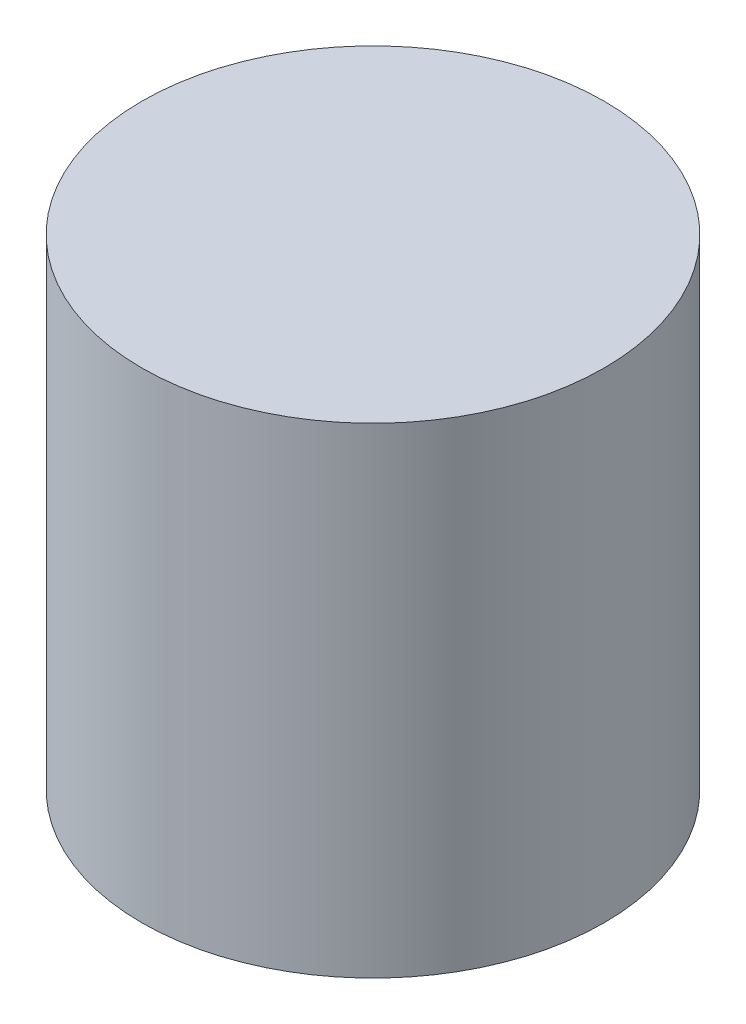
ISO-10303-21;
HEADER;
FILE_DESCRIPTION(('STEP AP214'),'2;1');
FILE_NAME('part.step','',(''),(''),'','','');
FILE_SCHEMA(('AUTOMOTIVE_DESIGN { 1 0 10303 214 1 1 1 1 }'));
ENDSEC;
DATA;
#1=APPLICATION_CONTEXT('core data for automotive mechanical design processes');
#2=APPLICATION_PROTOCOL_DEFINITION('international standard','automotive_design',2000,#1);
#3=PRODUCT_CONTEXT('',#1,'mechanical');
#4=PRODUCT('Part','Part','',(#3));
#5=PRODUCT_RELATED_PRODUCT_CATEGORY('part','',(#4));
#6=PRODUCT_DEFINITION_FORMATION('','',#4);
#7=PRODUCT_DEFINITION_CONTEXT('part definition',#1,'design');
#8=PRODUCT_DEFINITION('design','',#6,#7);
#9=PRODUCT_DEFINITION_SHAPE('','',#8);
#10=(LENGTH_UNIT() NAMED_UNIT(*) SI_UNIT(.MILLI.,.METRE.));
#11=(NAMED_UNIT(*) PLANE_ANGLE_UNIT() SI_UNIT($,.RADIAN.));
#12=(NAMED_UNIT(*) SI_UNIT($,.STERADIAN.) SOLID_ANGLE_UNIT());
#13=UNCERTAINTY_MEASURE_WITH_UNIT(LENGTH_MEASURE(1.E-05),#10,'distance_accuracy_value','');
#14=(GEOMETRIC_REPRESENTATION_CONTEXT(3) GLOBAL_UNCERTAINTY_ASSIGNED_CONTEXT((#13)) GLOBAL_UNIT_ASSIGNED_CONTEXT((#10,
#11,#12)) REPRESENTATION_CONTEXT('',''));
#15=CARTESIAN_POINT('',(0.,0.,0.));
#16=DIRECTION('',(0.,0.,1.));
#17=DIRECTION('',(1.,0.,0.));
#18=AXIS2_PLACEMENT_3D('',#15,#16,#17);
#19=CARTESIAN_POINT('',(0.,79.,0.));
#20=DIRECTION('',(0.,-1.,0.));
#21=DIRECTION('',(0.,0.,-1.));
#22=AXIS2_PLACEMENT_3D('',#19,#20,#21);
#23=CYLINDRICAL_SURFACE('',#22,38.);
#24=CARTESIAN_POINT('',(0.,79.,0.));
#25=DIRECTION('',(0.,1.,0.));
#26=DIRECTION('',(0.,0.,1.));
#27=AXIS2_PLACEMENT_3D('',#24,#25,#26);
#28=CIRCLE('',#27,38.);
#29=CARTESIAN_POINT('',(0.,79.,38.));
#30=VERTEX_POINT('',#29);
#31=EDGE_CURVE('E10',#30,#30,#28,.T.);
#32=ORIENTED_EDGE('',*,*,#31,.F.);
#33=EDGE_LOOP('',(#32));
#34=FACE_BOUND('',#33,.T.);
#35=CARTESIAN_POINT('',(0.,0.,0.));
#36=DIRECTION('',(0.,1.,0.));
#37=DIRECTION('',(0.,0.,1.));
#38=AXIS2_PLACEMENT_3D('',#35,#36,#37);
#39=CIRCLE('',#38,38.);
#40=CARTESIAN_POINT('',(0.,0.,38.));
#41=VERTEX_POINT('',#40);
#42=EDGE_CURVE('E33',#41,#41,#39,.T.);
#43=ORIENTED_EDGE('',*,*,#42,.T.);
#44=EDGE_LOOP('',(#43));
#45=FACE_BOUND('',#44,.T.);
#46=ADVANCED_FACE('F30',(#34,#45),#23,.T.);
#47=CARTESIAN_POINT('',(0.,79.,0.));
#48=DIRECTION('',(0.,1.,0.));
#49=DIRECTION('',(0.,0.,1.));
#50=AXIS2_PLACEMENT_3D('',#47,#48,#49);
#51=PLANE('',#50);
#52=ORIENTED_EDGE('',*,*,#31,.T.);
#53=EDGE_LOOP('',(#52));
#54=FACE_BOUND('',#53,.T.);
#55=ADVANCED_FACE('F59',(#54),#51,.T.);
#56=CARTESIAN_POINT('',(0.,0.,0.));
#57=DIRECTION('',(0.,1.,0.));
#58=DIRECTION('',(0.,0.,1.));
#59=AXIS2_PLACEMENT_3D('',#56,#57,#58);
#60=PLANE('',#59);
#61=CARTESIAN_POINT('',(0.,0.,0.));
#62=DIRECTION('',(0.,-1.,0.));
#63=DIRECTION('',(0.,0.,-1.));
#64=AXIS2_PLACEMENT_3D('',#61,#62,#63);
#65=CIRCLE('',#64,36.5);
#66=CARTESIAN_POINT('',(0.,0.,-36.5));
#67=VERTEX_POINT('',#66);
#68=EDGE_CURVE('E42',#67,#67,#65,.T.);
#69=ORIENTED_EDGE('',*,*,#68,.F.);
#70=EDGE_LOOP('',(#69));
#71=FACE_BOUND('',#70,.T.);
#72=ORIENTED_EDGE('',*,*,#42,.F.);
#73=EDGE_LOOP('',(#72));
#74=FACE_BOUND('',#73,.T.);
#75=ADVANCED_FACE('F53',(#71,#74),#60,.F.);
#76=CARTESIAN_POINT('',(0.,76.,0.));
#77=DIRECTION('',(0.,-1.,0.));
#78=DIRECTION('',(0.,0.,-1.));
#79=AXIS2_PLACEMENT_3D('',#76,#77,#78);
#80=CYLINDRICAL_SURFACE('',#79,36.5);
#81=CARTESIAN_POINT('',(0.,76.,0.));
#82=DIRECTION('',(0.,-1.,0.));
#83=DIRECTION('',(0.,0.,-1.));
#84=AXIS2_PLACEMENT_3D('',#81,#82,#83);
#85=CIRCLE('',#84,36.5);
#86=CARTESIAN_POINT('',(0.,76.,-36.5));
#87=VERTEX_POINT('',#86);
#88=EDGE_CURVE('E40',#87,#87,#85,.T.);
#89=ORIENTED_EDGE('',*,*,#88,.F.);
#90=EDGE_LOOP('',(#89));
#91=FACE_BOUND('',#90,.T.);
#92=ORIENTED_EDGE('',*,*,#68,.T.);
#93=EDGE_LOOP('',(#92));
#94=FACE_BOUND('',#93,.T.);
#95=ADVANCED_FACE('F50',(#91,#94),#80,.F.);
#96=CARTESIAN_POINT('',(0.,76.,0.));
#97=DIRECTION('',(0.,-1.,0.));
#98=DIRECTION('',(0.,0.,-1.));
#99=AXIS2_PLACEMENT_3D('',#96,#97,#98);
#100=PLANE('',#99);
#101=ORIENTED_EDGE('',*,*,#88,.T.);
#102=EDGE_LOOP('',(#101));
#103=FACE_BOUND('',#102,.T.);
#104=ADVANCED_FACE('F48',(#103),#100,.T.);
#105=CLOSED_SHELL('',(#46,#55,#75,#95,#104));
#106=MANIFOLD_SOLID_BREP('B2',#105);
#107=ADVANCED_BREP_SHAPE_REPRESENTATION('',(#18,#106),#14);
#108=SHAPE_DEFINITION_REPRESENTATION(#9,#107);
ENDSEC;
END-ISO-10303-21;
